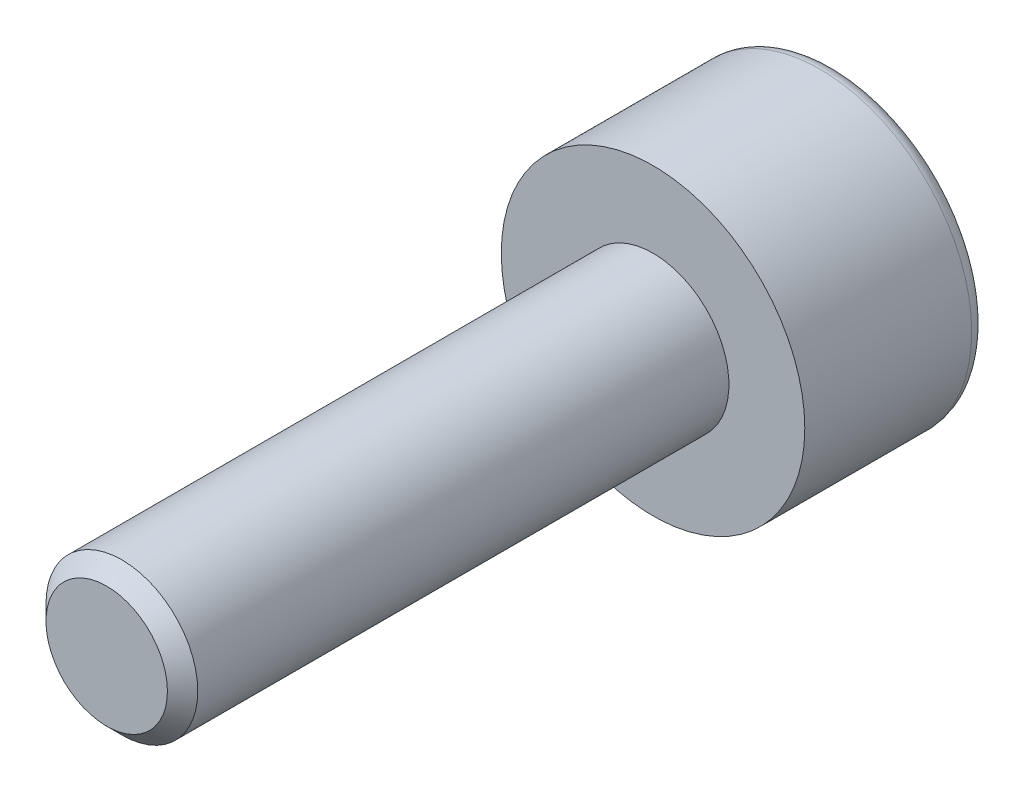
ISO-10303-21;
HEADER;
FILE_DESCRIPTION(('STEP AP214'),'2;1');
FILE_NAME('part.step','',(''),(''),'','','');
FILE_SCHEMA(('AUTOMOTIVE_DESIGN { 1 0 10303 214 1 1 1 1 }'));
ENDSEC;
DATA;
#1=APPLICATION_CONTEXT('core data for automotive mechanical design processes');
#2=APPLICATION_PROTOCOL_DEFINITION('international standard','automotive_design',2000,#1);
#3=PRODUCT_CONTEXT('',#1,'mechanical');
#4=PRODUCT('Part','Part','',(#3));
#5=PRODUCT_RELATED_PRODUCT_CATEGORY('part','',(#4));
#6=PRODUCT_DEFINITION_FORMATION('','',#4);
#7=PRODUCT_DEFINITION_CONTEXT('part definition',#1,'design');
#8=PRODUCT_DEFINITION('design','',#6,#7);
#9=PRODUCT_DEFINITION_SHAPE('','',#8);
#10=(LENGTH_UNIT() NAMED_UNIT(*) SI_UNIT(.MILLI.,.METRE.));
#11=(NAMED_UNIT(*) PLANE_ANGLE_UNIT() SI_UNIT($,.RADIAN.));
#12=(NAMED_UNIT(*) SI_UNIT($,.STERADIAN.) SOLID_ANGLE_UNIT());
#13=UNCERTAINTY_MEASURE_WITH_UNIT(LENGTH_MEASURE(1.E-05),#10,'distance_accuracy_value','');
#14=(GEOMETRIC_REPRESENTATION_CONTEXT(3) GLOBAL_UNCERTAINTY_ASSIGNED_CONTEXT((#13)) GLOBAL_UNIT_ASSIGNED_CONTEXT((#10,
#11,#12)) REPRESENTATION_CONTEXT('',''));
#15=CARTESIAN_POINT('',(0.,0.,0.));
#16=DIRECTION('',(0.,0.,1.));
#17=DIRECTION('',(1.,0.,0.));
#18=AXIS2_PLACEMENT_3D('',#15,#16,#17);
#19=CARTESIAN_POINT('',(0.,0.,18.));
#20=DIRECTION('',(0.,0.,-1.));
#21=DIRECTION('',(-1.,0.,0.));
#22=AXIS2_PLACEMENT_3D('',#19,#20,#21);
#23=CYLINDRICAL_SURFACE('',#22,2.5);
#24=CARTESIAN_POINT('',(0.,0.,17.5));
#25=DIRECTION('',(0.,0.,1.));
#26=DIRECTION('',(1.,0.,0.));
#27=AXIS2_PLACEMENT_3D('',#24,#25,#26);
#28=CIRCLE('',#27,2.5);
#29=CARTESIAN_POINT('',(2.5,0.,17.5));
#30=VERTEX_POINT('',#29);
#31=EDGE_CURVE('E106',#30,#30,#28,.F.);
#32=ORIENTED_EDGE('',*,*,#31,.T.);
#33=EDGE_LOOP('',(#32));
#34=FACE_BOUND('',#33,.T.);
#35=CARTESIAN_POINT('',(0.,0.,0.));
#36=DIRECTION('',(0.,0.,-1.));
#37=DIRECTION('',(-1.,0.,0.));
#38=AXIS2_PLACEMENT_3D('',#35,#36,#37);
#39=CIRCLE('',#38,2.5);
#40=CARTESIAN_POINT('',(-2.5,0.,0.));
#41=VERTEX_POINT('',#40);
#42=EDGE_CURVE('E209',#41,#41,#39,.T.);
#43=ORIENTED_EDGE('',*,*,#42,.F.);
#44=EDGE_LOOP('',(#43));
#45=FACE_BOUND('',#44,.T.);
#46=ADVANCED_FACE('F36',(#34,#45),#23,.T.);
#47=CARTESIAN_POINT('',(0.,0.,18.));
#48=DIRECTION('',(0.,0.,1.));
#49=DIRECTION('',(1.,0.,0.));
#50=AXIS2_PLACEMENT_3D('',#47,#48,#49);
#51=PLANE('',#50);
#52=CARTESIAN_POINT('',(0.,0.,18.));
#53=DIRECTION('',(0.,0.,1.));
#54=DIRECTION('',(1.,0.,0.));
#55=AXIS2_PLACEMENT_3D('',#52,#53,#54);
#56=CIRCLE('',#55,2.);
#57=CARTESIAN_POINT('',(2.,0.,18.));
#58=VERTEX_POINT('',#57);
#59=EDGE_CURVE('E211',#58,#58,#56,.T.);
#60=ORIENTED_EDGE('',*,*,#59,.T.);
#61=EDGE_LOOP('',(#60));
#62=FACE_BOUND('',#61,.T.);
#63=ADVANCED_FACE('F197',(#62),#51,.T.);
#64=CARTESIAN_POINT('',(0.,0.,18.));
#65=DIRECTION('',(0.,0.,-1.));
#66=DIRECTION('',(-1.,0.,0.));
#67=AXIS2_PLACEMENT_3D('',#64,#65,#66);
#68=CONICAL_SURFACE('',#67,2.,0.785398163397448);
#69=ORIENTED_EDGE('',*,*,#31,.F.);
#70=EDGE_LOOP('',(#69));
#71=FACE_BOUND('',#70,.T.);
#72=ORIENTED_EDGE('',*,*,#59,.F.);
#73=EDGE_LOOP('',(#72));
#74=FACE_BOUND('',#73,.T.);
#75=ADVANCED_FACE('F202',(#71,#74),#68,.T.);
#76=CARTESIAN_POINT('',(0.,0.,0.));
#77=DIRECTION('',(0.,0.,-1.));
#78=DIRECTION('',(-1.,0.,0.));
#79=AXIS2_PLACEMENT_3D('',#76,#77,#78);
#80=PLANE('',#79);
#81=CARTESIAN_POINT('',(0.,0.,0.));
#82=DIRECTION('',(0.,0.,-1.));
#83=DIRECTION('',(-1.,0.,0.));
#84=AXIS2_PLACEMENT_3D('',#81,#82,#83);
#85=CIRCLE('',#84,5.);
#86=CARTESIAN_POINT('',(-5.,0.,0.));
#87=VERTEX_POINT('',#86);
#88=EDGE_CURVE('E212',#87,#87,#85,.T.);
#89=ORIENTED_EDGE('',*,*,#88,.F.);
#90=EDGE_LOOP('',(#89));
#91=FACE_BOUND('',#90,.T.);
#92=ORIENTED_EDGE('',*,*,#42,.T.);
#93=EDGE_LOOP('',(#92));
#94=FACE_BOUND('',#93,.T.);
#95=ADVANCED_FACE('F267',(#91,#94),#80,.F.);
#96=CARTESIAN_POINT('',(0.,0.,-6.));
#97=DIRECTION('',(0.,0.,1.));
#98=DIRECTION('',(1.,0.,0.));
#99=AXIS2_PLACEMENT_3D('',#96,#97,#98);
#100=CYLINDRICAL_SURFACE('',#99,5.);
#101=CARTESIAN_POINT('',(0.,0.,-5.5));
#102=DIRECTION('',(0.,0.,-1.));
#103=DIRECTION('',(-1.,0.,0.));
#104=AXIS2_PLACEMENT_3D('',#101,#102,#103);
#105=CIRCLE('',#104,5.);
#106=CARTESIAN_POINT('',(-5.,0.,-5.5));
#107=VERTEX_POINT('',#106);
#108=EDGE_CURVE('E11',#107,#107,#105,.F.);
#109=ORIENTED_EDGE('',*,*,#108,.T.);
#110=EDGE_LOOP('',(#109));
#111=FACE_BOUND('',#110,.T.);
#112=ORIENTED_EDGE('',*,*,#88,.T.);
#113=EDGE_LOOP('',(#112));
#114=FACE_BOUND('',#113,.T.);
#115=ADVANCED_FACE('F261',(#111,#114),#100,.T.);
#116=CARTESIAN_POINT('',(0.,0.,-6.));
#117=DIRECTION('',(0.,0.,-1.));
#118=DIRECTION('',(-1.,0.,0.));
#119=AXIS2_PLACEMENT_3D('',#116,#117,#118);
#120=PLANE('',#119);
#121=CARTESIAN_POINT('',(0.,0.,-6.));
#122=DIRECTION('',(0.,0.,-1.));
#123=DIRECTION('',(-1.,0.,0.));
#124=AXIS2_PLACEMENT_3D('',#121,#122,#123);
#125=CIRCLE('',#124,4.5);
#126=CARTESIAN_POINT('',(-4.5,0.,-6.));
#127=VERTEX_POINT('',#126);
#128=EDGE_CURVE('E43',#127,#127,#125,.T.);
#129=ORIENTED_EDGE('',*,*,#128,.T.);
#130=EDGE_LOOP('',(#129));
#131=FACE_BOUND('',#130,.T.);
#132=CARTESIAN_POINT('',(0.,0.,-6.));
#133=DIRECTION('',(0.,0.,-1.));
#134=DIRECTION('',(-1.,0.,0.));
#135=AXIS2_PLACEMENT_3D('',#132,#133,#134);
#136=CIRCLE('',#135,3.);
#137=CARTESIAN_POINT('',(-3.,0.,-6.));
#138=VERTEX_POINT('',#137);
#139=CARTESIAN_POINT('',(-1.50000000000002,2.5980762113533,-6.));
#140=VERTEX_POINT('',#139);
#141=EDGE_CURVE('E129',#138,#140,#136,.T.);
#142=ORIENTED_EDGE('',*,*,#141,.F.);
#143=CARTESIAN_POINT('',(-1.50000000000002,-2.5980762113533,-6.));
#144=VERTEX_POINT('',#143);
#145=EDGE_CURVE('E128',#144,#138,#136,.T.);
#146=ORIENTED_EDGE('',*,*,#145,.F.);
#147=CARTESIAN_POINT('',(1.50000000000002,-2.5980762113533,-6.));
#148=VERTEX_POINT('',#147);
#149=EDGE_CURVE('E96',#148,#144,#136,.T.);
#150=ORIENTED_EDGE('',*,*,#149,.F.);
#151=CARTESIAN_POINT('',(3.,0.,-6.));
#152=VERTEX_POINT('',#151);
#153=EDGE_CURVE('E88',#152,#148,#136,.T.);
#154=ORIENTED_EDGE('',*,*,#153,.F.);
#155=CARTESIAN_POINT('',(1.50000000000002,2.5980762113533,-6.));
#156=VERTEX_POINT('',#155);
#157=EDGE_CURVE('E49',#156,#152,#136,.T.);
#158=ORIENTED_EDGE('',*,*,#157,.F.);
#159=EDGE_CURVE('E56',#140,#156,#136,.T.);
#160=ORIENTED_EDGE('',*,*,#159,.F.);
#161=EDGE_LOOP('',(#142,#146,#150,#154,#158,#160));
#162=FACE_BOUND('',#161,.T.);
#163=ADVANCED_FACE('F127',(#131,#162),#120,.T.);
#164=CARTESIAN_POINT('',(0.,0.,-6.));
#165=DIRECTION('',(0.,0.,-1.));
#166=DIRECTION('',(-1.,0.,0.));
#167=AXIS2_PLACEMENT_3D('',#164,#165,#166);
#168=CONICAL_SURFACE('',#167,3.,0.78539816339745);
#169=ORIENTED_EDGE('',*,*,#149,.T.);
#170=CARTESIAN_POINT('',(-3.0909254744471,-2.5980762113533,-7.03779894107989));
#171=CARTESIAN_POINT('',(-3.01609560147318,-2.5980762113533,-6.98052976338315));
#172=CARTESIAN_POINT('',(-2.94085808102586,-2.5980762113533,-6.92378477871504));
#173=CARTESIAN_POINT('',(-2.78940274464782,-2.5980762113533,-6.81158134782241));
#174=CARTESIAN_POINT('',(-2.71318469724391,-2.5980762113533,-6.75612321438144));
#175=CARTESIAN_POINT('',(-2.55904595524117,-2.5980762113533,-6.64633691499178));
#176=CARTESIAN_POINT('',(-2.48111665507094,-2.5980762113533,-6.59202079125551));
#177=CARTESIAN_POINT('',(-2.32395352811992,-2.5980762113533,-6.48531624076521));
#178=CARTESIAN_POINT('',(-2.2447197923234,-2.5980762113533,-6.43292768038147));
#179=CARTESIAN_POINT('',(-2.07978975847319,-2.5980762113533,-6.32735102227732));
#180=CARTESIAN_POINT('',(-1.99399660792959,-2.5980762113533,-6.27431346331794));
#181=CARTESIAN_POINT('',(-1.82042376380584,-2.5980762113533,-6.17160018577123));
#182=CARTESIAN_POINT('',(-1.73264433200394,-2.5980762113533,-6.12192402757832));
#183=CARTESIAN_POINT('',(-1.55504638047903,-2.5980762113533,-6.02697100961477));
#184=CARTESIAN_POINT('',(-1.46523449823233,-2.5980762113533,-5.98168183241538));
#185=CARTESIAN_POINT('',(-1.28309639217812,-2.5980762113533,-5.89652560517698));
#186=CARTESIAN_POINT('',(-1.19077136564949,-2.5980762113533,-5.85665602564665));
#187=CARTESIAN_POINT('',(-1.01220342121134,-2.5980762113533,-5.7871929624845));
#188=CARTESIAN_POINT('',(-0.926201371150999,-2.5980762113533,-5.7569866071583));
#189=CARTESIAN_POINT('',(-0.75203987653912,-2.5980762113533,-5.70346151366559));
#190=CARTESIAN_POINT('',(-0.663880292033994,-2.5980762113533,-5.68014322359895));
#191=CARTESIAN_POINT('',(-0.487445704832126,-2.5980762113533,-5.64203194743155));
#192=CARTESIAN_POINT('',(-0.399204164566021,-2.5980762113533,-5.62708663001538));
#193=CARTESIAN_POINT('',(-0.22166774250037,-2.5980762113533,-5.60602734932386));
#194=CARTESIAN_POINT('',(-0.132373071588484,-2.5980762113533,-5.59991164721827));
#195=CARTESIAN_POINT('',(0.042661627528874,-2.5980762113533,-5.59701385213961));
#196=CARTESIAN_POINT('',(0.1283955006183,-2.5980762113533,-5.59985521041613));
#197=CARTESIAN_POINT('',(0.2991757517099,-2.5980762113533,-5.61385912535361));
#198=CARTESIAN_POINT('',(0.384222065220373,-2.5980762113533,-5.62502245365116));
#199=CARTESIAN_POINT('',(0.554454694803822,-2.5980762113533,-5.65523431380741));
#200=CARTESIAN_POINT('',(0.639616186739342,-2.5980762113533,-5.6744206212315));
#201=CARTESIAN_POINT('',(0.808061166156998,-2.5980762113533,-5.71962885143383));
#202=CARTESIAN_POINT('',(0.891344774555675,-2.5980762113533,-5.74565033272397));
#203=CARTESIAN_POINT('',(1.14922819817197,-2.5980762113533,-5.83612510042675));
#204=CARTESIAN_POINT('',(1.32028918001752,-2.5980762113533,-5.91069918648877));
#205=CARTESIAN_POINT('',(1.57063806892422,-2.5980762113533,-6.0350725907495));
#206=CARTESIAN_POINT('',(1.65320141567331,-2.5980762113533,-6.07871271409593));
#207=CARTESIAN_POINT('',(1.81645750748494,-2.5980762113533,-6.16936963527677));
#208=CARTESIAN_POINT('',(1.89715058026158,-2.5980762113533,-6.21638583553852));
#209=CARTESIAN_POINT('',(2.05293461992097,-2.5980762113533,-6.3107240087079));
#210=CARTESIAN_POINT('',(2.12810528015501,-2.5980762113533,-6.35791586771668));
#211=CARTESIAN_POINT('',(2.27715698319733,-2.5980762113533,-6.45430371244762));
#212=CARTESIAN_POINT('',(2.35103792844459,-2.5980762113533,-6.50349984885377));
#213=CARTESIAN_POINT('',(2.49708171490433,-2.5980762113533,-6.60313535887655));
#214=CARTESIAN_POINT('',(2.56925360089667,-2.5980762113533,-6.65356152980463));
#215=CARTESIAN_POINT('',(2.71260816345548,-2.5980762113533,-6.75576122458668));
#216=CARTESIAN_POINT('',(2.78379110711019,-2.5980762113533,-6.80753437336118));
#217=CARTESIAN_POINT('',(2.85455959033784,-2.5980762113533,-6.85985886462053));
#218=B_SPLINE_CURVE_WITH_KNOTS('',3,(#170,#171,#172,#173,#174,#175,#176,#177,#178,#179,#180,
#181,#182,#183,#184,#185,#186,#187,#188,#189,#190,#191,#192,#193,#194,#195,#196,#197,#198,#199,
#200,#201,#202,#203,#204,#205,#206,#207,#208,#209,#210,#211,#212,#213,#214,#215,#216,#217),
.UNSPECIFIED.,.F.,.F.,(4,2,2,2,2,2,2,2,2,2,2,2,2,2,2,2,2,2,2,2,2,2,2,4),(0.,0.28269491196721,
0.565457831187448,0.850405622618952,1.13533362247553,1.43786342834013,1.74035359243847,
2.04196820958769,2.34344156708326,2.61666213397785,2.88990047119611,3.15799130854665,
3.42602934313572,3.68295179411801,3.9398980706399,4.20145080025632,4.46298664017248,
5.02108363165144,5.30122174253259,5.58131039003158,5.84754726308001,6.11380418920766,
6.37791688421142,6.64195680533786),.UNSPECIFIED.);
#219=EDGE_CURVE('E101',#148,#144,#218,.F.);
#220=ORIENTED_EDGE('',*,*,#219,.F.);
#221=EDGE_LOOP('',(#169,#220));
#222=FACE_BOUND('',#221,.T.);
#223=ADVANCED_FACE('F102',(#222),#168,.F.);
#224=ORIENTED_EDGE('',*,*,#145,.T.);
#225=CARTESIAN_POINT('',(-1.49988452994618,-2.59827621135331,-6.00011547672025));
#226=CARTESIAN_POINT('',(-1.55144722349693,-2.5089670063483,-5.94859636710928));
#227=CARTESIAN_POINT('',(-1.6038721167393,-2.41816442767115,-5.90010301823351));
#228=CARTESIAN_POINT('',(-1.71077226218964,-2.23300794441466,-5.8113127963772));
#229=CARTESIAN_POINT('',(-1.7652576811698,-2.13863643046933,-5.7710653269156));
#230=CARTESIAN_POINT('',(-1.87512493116898,-1.94834077138288,-5.70212059647247));
#231=CARTESIAN_POINT('',(-1.93047878107056,-1.8524650909588,-5.67325004305937));
#232=CARTESIAN_POINT('',(-2.04240509746256,-1.65860302426382,-5.62876894035459));
#233=CARTESIAN_POINT('',(-2.09897414464144,-1.56062256041424,-5.61312518652802));
#234=CARTESIAN_POINT('',(-2.19646775987113,-1.39175866542284,-5.59901048483914));
#235=CARTESIAN_POINT('',(-2.23726637253301,-1.32109339541415,-5.59692103515086));
#236=CARTESIAN_POINT('',(-2.31879690787064,-1.17987836584109,-5.60044102366014));
#237=CARTESIAN_POINT('',(-2.35952880215514,-1.1093286554518,-5.60605316092093));
#238=CARTESIAN_POINT('',(-2.44060798692279,-0.968895387997977,-5.62465695770247));
#239=CARTESIAN_POINT('',(-2.48095479574429,-0.899012665195864,-5.63765687232659));
#240=CARTESIAN_POINT('',(-2.56095071959361,-0.760455660690429,-5.67032262564967));
#241=CARTESIAN_POINT('',(-2.60059988786286,-0.69178128677025,-5.68998795332682));
#242=CARTESIAN_POINT('',(-2.70215750741298,-0.515878329813696,-5.74836826027799));
#243=CARTESIAN_POINT('',(-2.76343628015068,-0.409740382006526,-5.79148364497911));
#244=CARTESIAN_POINT('',(-2.85354136829701,-0.253673791316608,-5.86426823555666));
#245=CARTESIAN_POINT('',(-2.88323502253944,-0.202242873506327,-5.88984137858558));
#246=CARTESIAN_POINT('',(-2.94207231156913,-0.100333699527287,-5.94331883691413));
#247=CARTESIAN_POINT('',(-2.97121627071293,-0.049854881556517,-5.97122172117172));
#248=CARTESIAN_POINT('',(-3.00011547005384,0.000200000000005751,-6.00011547672025));
#249=B_SPLINE_CURVE_WITH_KNOTS('',3,(#225,#226,#227,#228,#229,#230,#231,#232,#233,#234,#235,
#236,#237,#238,#239,#240,#241,#242,#243,#244,#245,#246,#247,#248),.UNSPECIFIED.,.F.,.F.,(4,2,2,
2,2,2,2,2,2,2,2,4),(0.,0.346074163660387,0.694164747986288,1.03672682350145,1.37842635662141,
1.62295169669973,1.86756275390828,2.11244767848964,2.35731383255521,2.74625844207636,
2.94020339848825,3.13403008860788),.UNSPECIFIED.);
#250=EDGE_CURVE('E131',#144,#138,#249,.T.);
#251=ORIENTED_EDGE('',*,*,#250,.F.);
#252=EDGE_LOOP('',(#224,#251));
#253=FACE_BOUND('',#252,.T.);
#254=ADVANCED_FACE('F251',(#253),#168,.F.);
#255=ORIENTED_EDGE('',*,*,#141,.T.);
#256=CARTESIAN_POINT('',(-3.00011547005384,-0.000200000000005751,-6.00011547672025));
#257=CARTESIAN_POINT('',(-2.94855277650309,0.0891092050050036,-5.94859636710928));
#258=CARTESIAN_POINT('',(-2.89612788326072,0.17991178368216,-5.90010301823351));
#259=CARTESIAN_POINT('',(-2.78922773781038,0.365068266938649,-5.8113127963772));
#260=CARTESIAN_POINT('',(-2.73474231883022,0.459439780883974,-5.77106532691561));
#261=CARTESIAN_POINT('',(-2.62487506883104,0.649735439970427,-5.70212059647247));
#262=CARTESIAN_POINT('',(-2.56952121892946,0.745611120394509,-5.67325004305937));
#263=CARTESIAN_POINT('',(-2.45759490253745,0.939473187089484,-5.62876894035459));
#264=CARTESIAN_POINT('',(-2.40102585535857,1.03745365093906,-5.61312518652803));
#265=CARTESIAN_POINT('',(-2.30353224012888,1.20631754593046,-5.59901048483914));
#266=CARTESIAN_POINT('',(-2.26273362746701,1.27698281593916,-5.59692103515086));
#267=CARTESIAN_POINT('',(-2.18120309212939,1.41819784551222,-5.60044102366014));
#268=CARTESIAN_POINT('',(-2.14047119784488,1.4887475559015,-5.60605316092093));
#269=CARTESIAN_POINT('',(-2.05939201307723,1.62918082335533,-5.62465695770247));
#270=CARTESIAN_POINT('',(-2.01904520425573,1.69906354615744,-5.63765687232659));
#271=CARTESIAN_POINT('',(-1.93904928040641,1.83762055066287,-5.67032262564967));
#272=CARTESIAN_POINT('',(-1.89940011213716,1.90629492458305,-5.68998795332682));
#273=CARTESIAN_POINT('',(-1.79784249258704,2.0821978815396,-5.74836826027799));
#274=CARTESIAN_POINT('',(-1.73656371984934,2.18833582934678,-5.79148364497911));
#275=CARTESIAN_POINT('',(-1.64645863170302,2.3444024200367,-5.86426823555665));
#276=CARTESIAN_POINT('',(-1.61676497746058,2.39583333784698,-5.88984137858558));
#277=CARTESIAN_POINT('',(-1.55792768843089,2.49774251182602,-5.94331883691412));
#278=CARTESIAN_POINT('',(-1.52878372928709,2.54822132979679,-5.97122172117172));
#279=CARTESIAN_POINT('',(-1.49988452994618,2.59827621135331,-6.00011547672025));
#280=B_SPLINE_CURVE_WITH_KNOTS('',3,(#256,#257,#258,#259,#260,#261,#262,#263,#264,#265,#266,
#267,#268,#269,#270,#271,#272,#273,#274,#275,#276,#277,#278,#279),.UNSPECIFIED.,.F.,.F.,(4,2,2,
2,2,2,2,2,2,2,2,4),(0.,0.346074163660388,0.69416474798629,1.03672682350146,1.37842635662142,
1.62295169669973,1.86756275390829,2.11244767848964,2.35731383255521,2.74625844207636,
2.94020339848825,3.13403008860788),.UNSPECIFIED.);
#281=EDGE_CURVE('E139',#138,#140,#280,.T.);
#282=ORIENTED_EDGE('',*,*,#281,.F.);
#283=EDGE_LOOP('',(#255,#282));
#284=FACE_BOUND('',#283,.T.);
#285=ADVANCED_FACE('F248',(#284),#168,.F.);
#286=ORIENTED_EDGE('',*,*,#159,.T.);
#287=CARTESIAN_POINT('',(-3.0909254744471,2.5980762113533,-7.03779894107989));
#288=CARTESIAN_POINT('',(-3.01609560147318,2.5980762113533,-6.98052976338315));
#289=CARTESIAN_POINT('',(-2.94085808102586,2.5980762113533,-6.92378477871504));
#290=CARTESIAN_POINT('',(-2.78940274464782,2.5980762113533,-6.81158134782241));
#291=CARTESIAN_POINT('',(-2.71318469724391,2.5980762113533,-6.75612321438144));
#292=CARTESIAN_POINT('',(-2.55904595524117,2.5980762113533,-6.64633691499178));
#293=CARTESIAN_POINT('',(-2.48111665507094,2.5980762113533,-6.59202079125551));
#294=CARTESIAN_POINT('',(-2.32395352811992,2.5980762113533,-6.48531624076521));
#295=CARTESIAN_POINT('',(-2.2447197923234,2.5980762113533,-6.43292768038147));
#296=CARTESIAN_POINT('',(-2.07978975847319,2.5980762113533,-6.32735102227732));
#297=CARTESIAN_POINT('',(-1.99399660792959,2.5980762113533,-6.27431346331794));
#298=CARTESIAN_POINT('',(-1.82042376380584,2.5980762113533,-6.17160018577123));
#299=CARTESIAN_POINT('',(-1.73264433200394,2.5980762113533,-6.12192402757832));
#300=CARTESIAN_POINT('',(-1.55504638047903,2.5980762113533,-6.02697100961477));
#301=CARTESIAN_POINT('',(-1.46523449823233,2.5980762113533,-5.98168183241538));
#302=CARTESIAN_POINT('',(-1.28309639217812,2.5980762113533,-5.89652560517698));
#303=CARTESIAN_POINT('',(-1.19077136564949,2.5980762113533,-5.85665602564665));
#304=CARTESIAN_POINT('',(-1.01220342121134,2.5980762113533,-5.7871929624845));
#305=CARTESIAN_POINT('',(-0.926201371150999,2.5980762113533,-5.7569866071583));
#306=CARTESIAN_POINT('',(-0.75203987653912,2.5980762113533,-5.70346151366559));
#307=CARTESIAN_POINT('',(-0.663880292033994,2.5980762113533,-5.68014322359895));
#308=CARTESIAN_POINT('',(-0.487445704832126,2.5980762113533,-5.64203194743155));
#309=CARTESIAN_POINT('',(-0.399204164566021,2.5980762113533,-5.62708663001538));
#310=CARTESIAN_POINT('',(-0.22166774250037,2.5980762113533,-5.60602734932386));
#311=CARTESIAN_POINT('',(-0.132373071588484,2.5980762113533,-5.59991164721827));
#312=CARTESIAN_POINT('',(0.042661627528874,2.5980762113533,-5.59701385213961));
#313=CARTESIAN_POINT('',(0.1283955006183,2.5980762113533,-5.59985521041613));
#314=CARTESIAN_POINT('',(0.2991757517099,2.5980762113533,-5.61385912535361));
#315=CARTESIAN_POINT('',(0.384222065220373,2.5980762113533,-5.62502245365116));
#316=CARTESIAN_POINT('',(0.554454694803822,2.5980762113533,-5.65523431380741));
#317=CARTESIAN_POINT('',(0.639616186739342,2.5980762113533,-5.6744206212315));
#318=CARTESIAN_POINT('',(0.808061166156998,2.5980762113533,-5.71962885143383));
#319=CARTESIAN_POINT('',(0.891344774555675,2.5980762113533,-5.74565033272397));
#320=CARTESIAN_POINT('',(1.14922819817197,2.5980762113533,-5.83612510042675));
#321=CARTESIAN_POINT('',(1.32028918001752,2.5980762113533,-5.91069918648877));
#322=CARTESIAN_POINT('',(1.57063806892422,2.5980762113533,-6.0350725907495));
#323=CARTESIAN_POINT('',(1.65320141567331,2.5980762113533,-6.07871271409593));
#324=CARTESIAN_POINT('',(1.81645750748494,2.5980762113533,-6.16936963527677));
#325=CARTESIAN_POINT('',(1.89715058026158,2.5980762113533,-6.21638583553852));
#326=CARTESIAN_POINT('',(2.05293461992097,2.5980762113533,-6.3107240087079));
#327=CARTESIAN_POINT('',(2.12810528015501,2.5980762113533,-6.35791586771668));
#328=CARTESIAN_POINT('',(2.27715698319733,2.5980762113533,-6.45430371244762));
#329=CARTESIAN_POINT('',(2.35103792844459,2.5980762113533,-6.50349984885377));
#330=CARTESIAN_POINT('',(2.49708171490433,2.5980762113533,-6.60313535887655));
#331=CARTESIAN_POINT('',(2.56925360089667,2.5980762113533,-6.65356152980463));
#332=CARTESIAN_POINT('',(2.71260816345548,2.5980762113533,-6.75576122458668));
#333=CARTESIAN_POINT('',(2.78379110711019,2.5980762113533,-6.80753437336118));
#334=CARTESIAN_POINT('',(2.85455959033784,2.5980762113533,-6.85985886462053));
#335=B_SPLINE_CURVE_WITH_KNOTS('',3,(#287,#288,#289,#290,#291,#292,#293,#294,#295,#296,#297,
#298,#299,#300,#301,#302,#303,#304,#305,#306,#307,#308,#309,#310,#311,#312,#313,#314,#315,#316,
#317,#318,#319,#320,#321,#322,#323,#324,#325,#326,#327,#328,#329,#330,#331,#332,#333,#334),
.UNSPECIFIED.,.F.,.F.,(4,2,2,2,2,2,2,2,2,2,2,2,2,2,2,2,2,2,2,2,2,2,2,4),(0.,0.28269491196721,
0.565457831187448,0.850405622618952,1.13533362247553,1.43786342834013,1.74035359243847,
2.04196820958769,2.34344156708326,2.61666213397785,2.88990047119611,3.15799130854665,
3.42602934313572,3.68295179411801,3.9398980706399,4.20145080025632,4.46298664017248,
5.02108363165144,5.30122174253259,5.58131039003158,5.84754726308001,6.11380418920766,
6.37791688421142,6.64195680533786),.UNSPECIFIED.);
#336=EDGE_CURVE('E165',#140,#156,#335,.T.);
#337=ORIENTED_EDGE('',*,*,#336,.F.);
#338=EDGE_LOOP('',(#286,#337));
#339=FACE_BOUND('',#338,.T.);
#340=ADVANCED_FACE('F257',(#339),#168,.F.);
#341=ORIENTED_EDGE('',*,*,#157,.T.);
#342=CARTESIAN_POINT('',(1.49988452994618,2.59827621135331,-6.00011547672025));
#343=CARTESIAN_POINT('',(1.55144722349693,2.5089670063483,-5.94859636710928));
#344=CARTESIAN_POINT('',(1.6038721167393,2.41816442767115,-5.90010301823351));
#345=CARTESIAN_POINT('',(1.71077226218964,2.23300794441466,-5.8113127963772));
#346=CARTESIAN_POINT('',(1.7652576811698,2.13863643046933,-5.7710653269156));
#347=CARTESIAN_POINT('',(1.87512493116898,1.94834077138288,-5.70212059647247));
#348=CARTESIAN_POINT('',(1.93047878107056,1.8524650909588,-5.67325004305937));
#349=CARTESIAN_POINT('',(2.04240509746256,1.65860302426382,-5.62876894035459));
#350=CARTESIAN_POINT('',(2.09897414464144,1.56062256041424,-5.61312518652802));
#351=CARTESIAN_POINT('',(2.19646775987113,1.39175866542284,-5.59901048483914));
#352=CARTESIAN_POINT('',(2.23726637253301,1.32109339541415,-5.59692103515086));
#353=CARTESIAN_POINT('',(2.31879690787064,1.17987836584109,-5.60044102366014));
#354=CARTESIAN_POINT('',(2.35952880215514,1.1093286554518,-5.60605316092093));
#355=CARTESIAN_POINT('',(2.44060798692279,0.968895387997977,-5.62465695770247));
#356=CARTESIAN_POINT('',(2.48095479574429,0.899012665195864,-5.63765687232659));
#357=CARTESIAN_POINT('',(2.56095071959361,0.760455660690429,-5.67032262564967));
#358=CARTESIAN_POINT('',(2.60059988786286,0.69178128677025,-5.68998795332682));
#359=CARTESIAN_POINT('',(2.70215750741298,0.515878329813696,-5.74836826027799));
#360=CARTESIAN_POINT('',(2.76343628015068,0.409740382006526,-5.79148364497911));
#361=CARTESIAN_POINT('',(2.85354136829701,0.253673791316608,-5.86426823555666));
#362=CARTESIAN_POINT('',(2.88323502253944,0.202242873506327,-5.88984137858558));
#363=CARTESIAN_POINT('',(2.94207231156913,0.100333699527287,-5.94331883691413));
#364=CARTESIAN_POINT('',(2.97121627071293,0.049854881556517,-5.97122172117172));
#365=CARTESIAN_POINT('',(3.00011547005384,-0.000200000000005751,-6.00011547672025));
#366=B_SPLINE_CURVE_WITH_KNOTS('',3,(#342,#343,#344,#345,#346,#347,#348,#349,#350,#351,#352,
#353,#354,#355,#356,#357,#358,#359,#360,#361,#362,#363,#364,#365),.UNSPECIFIED.,.F.,.F.,(4,2,2,
2,2,2,2,2,2,2,2,4),(0.,0.346074163660387,0.694164747986288,1.03672682350145,1.37842635662141,
1.62295169669973,1.86756275390828,2.11244767848964,2.35731383255521,2.74625844207636,
2.94020339848825,3.13403008860788),.UNSPECIFIED.);
#367=EDGE_CURVE('E116',#156,#152,#366,.T.);
#368=ORIENTED_EDGE('',*,*,#367,.F.);
#369=EDGE_LOOP('',(#341,#368));
#370=FACE_BOUND('',#369,.T.);
#371=ADVANCED_FACE('F153',(#370),#168,.F.);
#372=ORIENTED_EDGE('',*,*,#153,.T.);
#373=CARTESIAN_POINT('',(3.00011547005384,0.000200000000005751,-6.00011547672025));
#374=CARTESIAN_POINT('',(2.94855277650309,-0.0891092050050036,-5.94859636710928));
#375=CARTESIAN_POINT('',(2.89612788326072,-0.17991178368216,-5.90010301823351));
#376=CARTESIAN_POINT('',(2.78922773781038,-0.365068266938649,-5.8113127963772));
#377=CARTESIAN_POINT('',(2.73474231883022,-0.459439780883974,-5.77106532691561));
#378=CARTESIAN_POINT('',(2.62487506883104,-0.649735439970427,-5.70212059647247));
#379=CARTESIAN_POINT('',(2.56952121892946,-0.745611120394509,-5.67325004305937));
#380=CARTESIAN_POINT('',(2.45759490253745,-0.939473187089484,-5.62876894035459));
#381=CARTESIAN_POINT('',(2.40102585535857,-1.03745365093906,-5.61312518652803));
#382=CARTESIAN_POINT('',(2.30353224012888,-1.20631754593046,-5.59901048483914));
#383=CARTESIAN_POINT('',(2.26273362746701,-1.27698281593916,-5.59692103515086));
#384=CARTESIAN_POINT('',(2.18120309212939,-1.41819784551222,-5.60044102366014));
#385=CARTESIAN_POINT('',(2.14047119784488,-1.4887475559015,-5.60605316092093));
#386=CARTESIAN_POINT('',(2.05939201307723,-1.62918082335533,-5.62465695770247));
#387=CARTESIAN_POINT('',(2.01904520425573,-1.69906354615744,-5.63765687232659));
#388=CARTESIAN_POINT('',(1.93904928040641,-1.83762055066287,-5.67032262564967));
#389=CARTESIAN_POINT('',(1.89940011213716,-1.90629492458305,-5.68998795332682));
#390=CARTESIAN_POINT('',(1.79784249258704,-2.0821978815396,-5.74836826027799));
#391=CARTESIAN_POINT('',(1.73656371984934,-2.18833582934678,-5.79148364497911));
#392=CARTESIAN_POINT('',(1.64645863170302,-2.3444024200367,-5.86426823555665));
#393=CARTESIAN_POINT('',(1.61676497746058,-2.39583333784698,-5.88984137858558));
#394=CARTESIAN_POINT('',(1.55792768843089,-2.49774251182602,-5.94331883691412));
#395=CARTESIAN_POINT('',(1.52878372928709,-2.54822132979679,-5.97122172117172));
#396=CARTESIAN_POINT('',(1.49988452994618,-2.59827621135331,-6.00011547672025));
#397=B_SPLINE_CURVE_WITH_KNOTS('',3,(#373,#374,#375,#376,#377,#378,#379,#380,#381,#382,#383,
#384,#385,#386,#387,#388,#389,#390,#391,#392,#393,#394,#395,#396),.UNSPECIFIED.,.F.,.F.,(4,2,2,
2,2,2,2,2,2,2,2,4),(0.,0.346074163660388,0.69416474798629,1.03672682350146,1.37842635662142,
1.62295169669973,1.86756275390829,2.11244767848964,2.35731383255521,2.74625844207636,
2.94020339848825,3.13403008860788),.UNSPECIFIED.);
#398=EDGE_CURVE('E92',#152,#148,#397,.T.);
#399=ORIENTED_EDGE('',*,*,#398,.F.);
#400=EDGE_LOOP('',(#372,#399));
#401=FACE_BOUND('',#400,.T.);
#402=ADVANCED_FACE('F90',(#401),#168,.F.);
#403=CARTESIAN_POINT('',(1.50000000000002,-2.5980762113533,-3.));
#404=DIRECTION('',(0.,0.,-1.));
#405=DIRECTION('',(-1.,0.,0.));
#406=AXIS2_PLACEMENT_3D('',#403,#404,#405);
#407=PLANE('',#406);
#408=DIRECTION('',(-0.499999999999998,-0.86602540378444,0.));
#409=VECTOR('',#408,1.);
#410=CARTESIAN_POINT('',(3.,0.,-3.));
#411=LINE('',#410,#409);
#412=CARTESIAN_POINT('',(3.,0.,-3.));
#413=VERTEX_POINT('',#412);
#414=CARTESIAN_POINT('',(1.50000000000002,-2.5980762113533,-3.));
#415=VERTEX_POINT('',#414);
#416=EDGE_CURVE('E115',#413,#415,#411,.T.);
#417=ORIENTED_EDGE('',*,*,#416,.T.);
#418=DIRECTION('',(-1.,0.,0.));
#419=VECTOR('',#418,1.);
#420=CARTESIAN_POINT('',(1.50000000000002,-2.5980762113533,-3.));
#421=LINE('',#420,#419);
#422=CARTESIAN_POINT('',(-1.50000000000002,-2.5980762113533,-3.));
#423=VERTEX_POINT('',#422);
#424=EDGE_CURVE('E120',#415,#423,#421,.T.);
#425=ORIENTED_EDGE('',*,*,#424,.T.);
#426=DIRECTION('',(-0.499999999999998,0.86602540378444,0.));
#427=VECTOR('',#426,1.);
#428=CARTESIAN_POINT('',(-3.,0.,-3.));
#429=LINE('',#428,#427);
#430=CARTESIAN_POINT('',(-3.,0.,-3.));
#431=VERTEX_POINT('',#430);
#432=EDGE_CURVE('E237',#423,#431,#429,.T.);
#433=ORIENTED_EDGE('',*,*,#432,.T.);
#434=DIRECTION('',(0.499999999999998,0.86602540378444,0.));
#435=VECTOR('',#434,1.);
#436=CARTESIAN_POINT('',(-3.,0.,-3.));
#437=LINE('',#436,#435);
#438=CARTESIAN_POINT('',(-1.50000000000002,2.5980762113533,-3.));
#439=VERTEX_POINT('',#438);
#440=EDGE_CURVE('E234',#431,#439,#437,.T.);
#441=ORIENTED_EDGE('',*,*,#440,.T.);
#442=DIRECTION('',(1.,0.,0.));
#443=VECTOR('',#442,1.);
#444=CARTESIAN_POINT('',(1.50000000000002,2.5980762113533,-3.));
#445=LINE('',#444,#443);
#446=CARTESIAN_POINT('',(1.50000000000002,2.5980762113533,-3.));
#447=VERTEX_POINT('',#446);
#448=EDGE_CURVE('E231',#439,#447,#445,.T.);
#449=ORIENTED_EDGE('',*,*,#448,.T.);
#450=DIRECTION('',(0.499999999999998,-0.86602540378444,0.));
#451=VECTOR('',#450,1.);
#452=CARTESIAN_POINT('',(3.,0.,-3.));
#453=LINE('',#452,#451);
#454=EDGE_CURVE('E123',#447,#413,#453,.T.);
#455=ORIENTED_EDGE('',*,*,#454,.T.);
#456=EDGE_LOOP('',(#417,#425,#433,#441,#449,#455));
#457=FACE_BOUND('',#456,.T.);
#458=ADVANCED_FACE('F152',(#457),#407,.T.);
#459=CARTESIAN_POINT('',(1.50000000000002,-2.5980762113533,-3.));
#460=DIRECTION('',(0.,-1.,0.));
#461=DIRECTION('',(0.,0.,-1.));
#462=AXIS2_PLACEMENT_3D('',#459,#460,#461);
#463=PLANE('',#462);
#464=DIRECTION('',(0.,0.,-1.));
#465=VECTOR('',#464,1.);
#466=CARTESIAN_POINT('',(1.50000000000002,-2.5980762113533,-3.));
#467=LINE('',#466,#465);
#468=EDGE_CURVE('E112',#415,#148,#467,.T.);
#469=ORIENTED_EDGE('',*,*,#468,.T.);
#470=ORIENTED_EDGE('',*,*,#219,.T.);
#471=DIRECTION('',(0.,0.,-1.));
#472=VECTOR('',#471,1.);
#473=CARTESIAN_POINT('',(-1.50000000000002,-2.5980762113533,-3.));
#474=LINE('',#473,#472);
#475=EDGE_CURVE('E122',#423,#144,#474,.T.);
#476=ORIENTED_EDGE('',*,*,#475,.F.);
#477=ORIENTED_EDGE('',*,*,#424,.F.);
#478=EDGE_LOOP('',(#469,#470,#476,#477));
#479=FACE_BOUND('',#478,.T.);
#480=ADVANCED_FACE('F118',(#479),#463,.F.);
#481=CARTESIAN_POINT('',(-3.,0.,-3.));
#482=DIRECTION('',(-0.86602540378444,-0.499999999999998,0.));
#483=DIRECTION('',(0.499999999999998,-0.86602540378444,0.));
#484=AXIS2_PLACEMENT_3D('',#481,#482,#483);
#485=PLANE('',#484);
#486=ORIENTED_EDGE('',*,*,#475,.T.);
#487=ORIENTED_EDGE('',*,*,#250,.T.);
#488=DIRECTION('',(0.,0.,-1.));
#489=VECTOR('',#488,1.);
#490=CARTESIAN_POINT('',(-3.,0.,-3.));
#491=LINE('',#490,#489);
#492=EDGE_CURVE('E220',#431,#138,#491,.T.);
#493=ORIENTED_EDGE('',*,*,#492,.F.);
#494=ORIENTED_EDGE('',*,*,#432,.F.);
#495=EDGE_LOOP('',(#486,#487,#493,#494));
#496=FACE_BOUND('',#495,.T.);
#497=ADVANCED_FACE('F145',(#496),#485,.F.);
#498=CARTESIAN_POINT('',(-3.,0.,-3.));
#499=DIRECTION('',(-0.86602540378444,0.499999999999998,0.));
#500=DIRECTION('',(-0.499999999999998,-0.86602540378444,0.));
#501=AXIS2_PLACEMENT_3D('',#498,#499,#500);
#502=PLANE('',#501);
#503=ORIENTED_EDGE('',*,*,#492,.T.);
#504=ORIENTED_EDGE('',*,*,#281,.T.);
#505=DIRECTION('',(0.,0.,-1.));
#506=VECTOR('',#505,1.);
#507=CARTESIAN_POINT('',(-1.50000000000002,2.5980762113533,-3.));
#508=LINE('',#507,#506);
#509=EDGE_CURVE('E222',#439,#140,#508,.T.);
#510=ORIENTED_EDGE('',*,*,#509,.F.);
#511=ORIENTED_EDGE('',*,*,#440,.F.);
#512=EDGE_LOOP('',(#503,#504,#510,#511));
#513=FACE_BOUND('',#512,.T.);
#514=ADVANCED_FACE('F186',(#513),#502,.F.);
#515=CARTESIAN_POINT('',(1.50000000000002,2.5980762113533,-3.));
#516=DIRECTION('',(0.,1.,0.));
#517=DIRECTION('',(0.,0.,1.));
#518=AXIS2_PLACEMENT_3D('',#515,#516,#517);
#519=PLANE('',#518);
#520=ORIENTED_EDGE('',*,*,#509,.T.);
#521=ORIENTED_EDGE('',*,*,#336,.T.);
#522=DIRECTION('',(0.,0.,-1.));
#523=VECTOR('',#522,1.);
#524=CARTESIAN_POINT('',(1.50000000000002,2.5980762113533,-3.));
#525=LINE('',#524,#523);
#526=EDGE_CURVE('E225',#447,#156,#525,.T.);
#527=ORIENTED_EDGE('',*,*,#526,.F.);
#528=ORIENTED_EDGE('',*,*,#448,.F.);
#529=EDGE_LOOP('',(#520,#521,#527,#528));
#530=FACE_BOUND('',#529,.T.);
#531=ADVANCED_FACE('F182',(#530),#519,.F.);
#532=CARTESIAN_POINT('',(3.,0.,-3.));
#533=DIRECTION('',(0.86602540378444,0.499999999999998,0.));
#534=DIRECTION('',(-0.499999999999998,0.86602540378444,0.));
#535=AXIS2_PLACEMENT_3D('',#532,#533,#534);
#536=PLANE('',#535);
#537=ORIENTED_EDGE('',*,*,#526,.T.);
#538=ORIENTED_EDGE('',*,*,#367,.T.);
#539=DIRECTION('',(0.,0.,-1.));
#540=VECTOR('',#539,1.);
#541=CARTESIAN_POINT('',(3.,0.,-3.));
#542=LINE('',#541,#540);
#543=EDGE_CURVE('E114',#413,#152,#542,.T.);
#544=ORIENTED_EDGE('',*,*,#543,.F.);
#545=ORIENTED_EDGE('',*,*,#454,.F.);
#546=EDGE_LOOP('',(#537,#538,#544,#545));
#547=FACE_BOUND('',#546,.T.);
#548=ADVANCED_FACE('F179',(#547),#536,.F.);
#549=CARTESIAN_POINT('',(3.,0.,-3.));
#550=DIRECTION('',(0.86602540378444,-0.499999999999998,0.));
#551=DIRECTION('',(0.499999999999998,0.86602540378444,0.));
#552=AXIS2_PLACEMENT_3D('',#549,#550,#551);
#553=PLANE('',#552);
#554=ORIENTED_EDGE('',*,*,#543,.T.);
#555=ORIENTED_EDGE('',*,*,#398,.T.);
#556=ORIENTED_EDGE('',*,*,#468,.F.);
#557=ORIENTED_EDGE('',*,*,#416,.F.);
#558=EDGE_LOOP('',(#554,#555,#556,#557));
#559=FACE_BOUND('',#558,.T.);
#560=ADVANCED_FACE('F110',(#559),#553,.F.);
#561=CARTESIAN_POINT('',(0.,0.,-5.5));
#562=DIRECTION('',(0.,0.,-1.));
#563=DIRECTION('',(-1.,0.,0.));
#564=AXIS2_PLACEMENT_3D('',#561,#562,#563);
#565=TOROIDAL_SURFACE('',#564,4.5,0.5);
#566=ORIENTED_EDGE('',*,*,#108,.F.);
#567=EDGE_LOOP('',(#566));
#568=FACE_BOUND('',#567,.T.);
#569=ORIENTED_EDGE('',*,*,#128,.F.);
#570=EDGE_LOOP('',(#569));
#571=FACE_BOUND('',#570,.T.);
#572=ADVANCED_FACE('F154',(#568,#571),#565,.T.);
#573=CLOSED_SHELL('',(#46,#63,#75,#95,#115,#163,#223,#254,#285,#340,#371,#402,#458,#480,#497,
#514,#531,#548,#560,#572));
#574=MANIFOLD_SOLID_BREP('B2',#573);
#575=ADVANCED_BREP_SHAPE_REPRESENTATION('',(#18,#574),#14);
#576=SHAPE_DEFINITION_REPRESENTATION(#9,#575);
ENDSEC;
END-ISO-10303-21;
